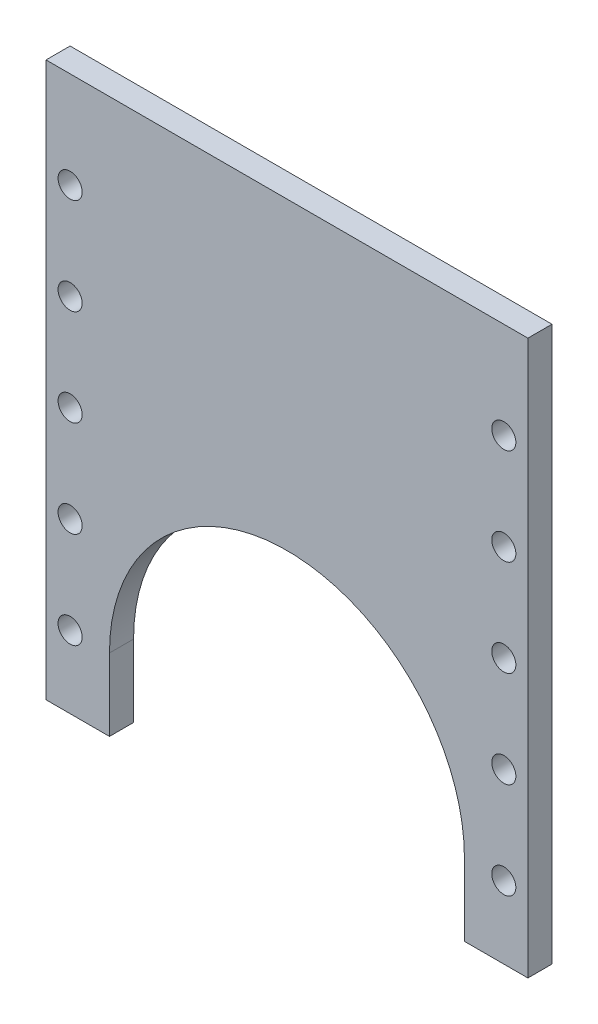
ISO-10303-21;
HEADER;
FILE_DESCRIPTION(('STEP AP214'),'2;1');
FILE_NAME('part.step','',(''),(''),'','','');
FILE_SCHEMA(('AUTOMOTIVE_DESIGN { 1 0 10303 214 1 1 1 1 }'));
ENDSEC;
DATA;
#1=APPLICATION_CONTEXT('core data for automotive mechanical design processes');
#2=APPLICATION_PROTOCOL_DEFINITION('international standard','automotive_design',2000,#1);
#3=PRODUCT_CONTEXT('',#1,'mechanical');
#4=PRODUCT('Part','Part','',(#3));
#5=PRODUCT_RELATED_PRODUCT_CATEGORY('part','',(#4));
#6=PRODUCT_DEFINITION_FORMATION('','',#4);
#7=PRODUCT_DEFINITION_CONTEXT('part definition',#1,'design');
#8=PRODUCT_DEFINITION('design','',#6,#7);
#9=PRODUCT_DEFINITION_SHAPE('','',#8);
#10=(LENGTH_UNIT() NAMED_UNIT(*) SI_UNIT(.MILLI.,.METRE.));
#11=(NAMED_UNIT(*) PLANE_ANGLE_UNIT() SI_UNIT($,.RADIAN.));
#12=(NAMED_UNIT(*) SI_UNIT($,.STERADIAN.) SOLID_ANGLE_UNIT());
#13=UNCERTAINTY_MEASURE_WITH_UNIT(LENGTH_MEASURE(1.E-05),#10,'distance_accuracy_value','');
#14=(GEOMETRIC_REPRESENTATION_CONTEXT(3) GLOBAL_UNCERTAINTY_ASSIGNED_CONTEXT((#13)) GLOBAL_UNIT_ASSIGNED_CONTEXT((#10,
#11,#12)) REPRESENTATION_CONTEXT('',''));
#15=CARTESIAN_POINT('',(0.,0.,0.));
#16=DIRECTION('',(0.,0.,1.));
#17=DIRECTION('',(1.,0.,0.));
#18=AXIS2_PLACEMENT_3D('',#15,#16,#17);
#19=CARTESIAN_POINT('',(0.,0.,5.));
#20=DIRECTION('',(0.,0.,1.));
#21=DIRECTION('',(1.,0.,0.));
#22=AXIS2_PLACEMENT_3D('',#19,#20,#21);
#23=PLANE('',#22);
#24=CARTESIAN_POINT('',(-45.0000000000002,60.,5.));
#25=DIRECTION('',(0.,0.,1.));
#26=DIRECTION('',(1.,0.,0.));
#27=AXIS2_PLACEMENT_3D('',#24,#25,#26);
#28=CIRCLE('',#27,2.5);
#29=CARTESIAN_POINT('',(-42.5000000000002,60.,5.));
#30=VERTEX_POINT('',#29);
#31=EDGE_CURVE('E237',#30,#30,#28,.T.);
#32=ORIENTED_EDGE('',*,*,#31,.F.);
#33=EDGE_LOOP('',(#32));
#34=FACE_BOUND('',#33,.T.);
#35=CARTESIAN_POINT('',(-45.0000000000001,20.,5.));
#36=DIRECTION('',(0.,0.,1.));
#37=DIRECTION('',(1.,0.,0.));
#38=AXIS2_PLACEMENT_3D('',#35,#36,#37);
#39=CIRCLE('',#38,2.5);
#40=CARTESIAN_POINT('',(-42.5000000000001,20.,5.));
#41=VERTEX_POINT('',#40);
#42=EDGE_CURVE('E225',#41,#41,#39,.T.);
#43=ORIENTED_EDGE('',*,*,#42,.F.);
#44=EDGE_LOOP('',(#43));
#45=FACE_BOUND('',#44,.T.);
#46=CARTESIAN_POINT('',(44.9999999999998,60.,5.));
#47=DIRECTION('',(0.,0.,1.));
#48=DIRECTION('',(1.,0.,0.));
#49=AXIS2_PLACEMENT_3D('',#46,#47,#48);
#50=CIRCLE('',#49,2.5);
#51=CARTESIAN_POINT('',(47.4999999999998,60.,5.));
#52=VERTEX_POINT('',#51);
#53=EDGE_CURVE('E213',#52,#52,#50,.T.);
#54=ORIENTED_EDGE('',*,*,#53,.F.);
#55=EDGE_LOOP('',(#54));
#56=FACE_BOUND('',#55,.T.);
#57=CARTESIAN_POINT('',(44.9999999999999,20.,5.));
#58=DIRECTION('',(0.,0.,1.));
#59=DIRECTION('',(1.,0.,0.));
#60=AXIS2_PLACEMENT_3D('',#57,#58,#59);
#61=CIRCLE('',#60,2.5);
#62=CARTESIAN_POINT('',(47.4999999999999,20.,5.));
#63=VERTEX_POINT('',#62);
#64=EDGE_CURVE('E201',#63,#63,#61,.T.);
#65=ORIENTED_EDGE('',*,*,#64,.F.);
#66=EDGE_LOOP('',(#65));
#67=FACE_BOUND('',#66,.T.);
#68=CARTESIAN_POINT('',(-45.,0.,5.));
#69=DIRECTION('',(0.,0.,1.));
#70=DIRECTION('',(1.,0.,0.));
#71=AXIS2_PLACEMENT_3D('',#68,#69,#70);
#72=CIRCLE('',#71,2.5);
#73=CARTESIAN_POINT('',(-42.5,0.,5.));
#74=VERTEX_POINT('',#73);
#75=EDGE_CURVE('E147',#74,#74,#72,.T.);
#76=ORIENTED_EDGE('',*,*,#75,.F.);
#77=EDGE_LOOP('',(#76));
#78=FACE_BOUND('',#77,.T.);
#79=DIRECTION('',(0.,1.,0.));
#80=VECTOR('',#79,1.);
#81=CARTESIAN_POINT('',(50.,-15.,5.));
#82=LINE('',#81,#80);
#83=CARTESIAN_POINT('',(50.,-15.,5.));
#84=VERTEX_POINT('',#83);
#85=CARTESIAN_POINT('',(50.,100.,5.));
#86=VERTEX_POINT('',#85);
#87=EDGE_CURVE('E158',#84,#86,#82,.T.);
#88=ORIENTED_EDGE('',*,*,#87,.T.);
#89=DIRECTION('',(-1.,0.,0.));
#90=VECTOR('',#89,1.);
#91=CARTESIAN_POINT('',(-50.,100.,5.));
#92=LINE('',#91,#90);
#93=CARTESIAN_POINT('',(-50.,100.,5.));
#94=VERTEX_POINT('',#93);
#95=EDGE_CURVE('E106',#86,#94,#92,.T.);
#96=ORIENTED_EDGE('',*,*,#95,.T.);
#97=DIRECTION('',(0.,-1.,0.));
#98=VECTOR('',#97,1.);
#99=CARTESIAN_POINT('',(-50.,-15.,5.));
#100=LINE('',#99,#98);
#101=CARTESIAN_POINT('',(-50.,-15.,5.));
#102=VERTEX_POINT('',#101);
#103=EDGE_CURVE('E173',#94,#102,#100,.T.);
#104=ORIENTED_EDGE('',*,*,#103,.T.);
#105=DIRECTION('',(1.,0.,0.));
#106=VECTOR('',#105,1.);
#107=CARTESIAN_POINT('',(-50.,-15.,5.));
#108=LINE('',#107,#106);
#109=CARTESIAN_POINT('',(-36.83,-15.,5.));
#110=VERTEX_POINT('',#109);
#111=EDGE_CURVE('E186',#102,#110,#108,.T.);
#112=ORIENTED_EDGE('',*,*,#111,.T.);
#113=DIRECTION('',(0.,1.,0.));
#114=VECTOR('',#113,1.);
#115=CARTESIAN_POINT('',(-36.83,0.,5.));
#116=LINE('',#115,#114);
#117=CARTESIAN_POINT('',(-36.83,0.,5.));
#118=VERTEX_POINT('',#117);
#119=EDGE_CURVE('E125',#110,#118,#116,.T.);
#120=ORIENTED_EDGE('',*,*,#119,.T.);
#121=CARTESIAN_POINT('',(0.,0.,5.));
#122=DIRECTION('',(0.,0.,-1.));
#123=DIRECTION('',(1.,0.,0.));
#124=AXIS2_PLACEMENT_3D('',#121,#122,#123);
#125=CIRCLE('',#124,36.83);
#126=CARTESIAN_POINT('',(36.83,0.,5.));
#127=VERTEX_POINT('',#126);
#128=EDGE_CURVE('E119',#118,#127,#125,.T.);
#129=ORIENTED_EDGE('',*,*,#128,.T.);
#130=DIRECTION('',(0.,-1.,0.));
#131=VECTOR('',#130,1.);
#132=CARTESIAN_POINT('',(36.83,0.,5.));
#133=LINE('',#132,#131);
#134=CARTESIAN_POINT('',(36.83,-15.,5.));
#135=VERTEX_POINT('',#134);
#136=EDGE_CURVE('E123',#127,#135,#133,.T.);
#137=ORIENTED_EDGE('',*,*,#136,.T.);
#138=DIRECTION('',(1.,0.,0.));
#139=VECTOR('',#138,1.);
#140=CARTESIAN_POINT('',(36.83,-15.,5.));
#141=LINE('',#140,#139);
#142=EDGE_CURVE('E63',#135,#84,#141,.T.);
#143=ORIENTED_EDGE('',*,*,#142,.T.);
#144=EDGE_LOOP('',(#88,#96,#104,#112,#120,#129,#137,#143));
#145=FACE_BOUND('',#144,.T.);
#146=CARTESIAN_POINT('',(45.,0.,5.));
#147=DIRECTION('',(0.,0.,1.));
#148=DIRECTION('',(1.,0.,0.));
#149=AXIS2_PLACEMENT_3D('',#146,#147,#148);
#150=CIRCLE('',#149,2.5);
#151=CARTESIAN_POINT('',(47.5,0.,5.));
#152=VERTEX_POINT('',#151);
#153=EDGE_CURVE('E195',#152,#152,#150,.T.);
#154=ORIENTED_EDGE('',*,*,#153,.F.);
#155=EDGE_LOOP('',(#154));
#156=FACE_BOUND('',#155,.T.);
#157=CARTESIAN_POINT('',(44.9999999999999,40.,5.));
#158=DIRECTION('',(0.,0.,1.));
#159=DIRECTION('',(1.,0.,0.));
#160=AXIS2_PLACEMENT_3D('',#157,#158,#159);
#161=CIRCLE('',#160,2.5);
#162=CARTESIAN_POINT('',(47.4999999999999,40.,5.));
#163=VERTEX_POINT('',#162);
#164=EDGE_CURVE('E207',#163,#163,#161,.T.);
#165=ORIENTED_EDGE('',*,*,#164,.F.);
#166=EDGE_LOOP('',(#165));
#167=FACE_BOUND('',#166,.T.);
#168=CARTESIAN_POINT('',(44.9999999999997,80.,5.));
#169=DIRECTION('',(0.,0.,1.));
#170=DIRECTION('',(1.,0.,0.));
#171=AXIS2_PLACEMENT_3D('',#168,#169,#170);
#172=CIRCLE('',#171,2.5);
#173=CARTESIAN_POINT('',(47.4999999999997,80.,5.));
#174=VERTEX_POINT('',#173);
#175=EDGE_CURVE('E219',#174,#174,#172,.T.);
#176=ORIENTED_EDGE('',*,*,#175,.F.);
#177=EDGE_LOOP('',(#176));
#178=FACE_BOUND('',#177,.T.);
#179=CARTESIAN_POINT('',(-45.0000000000001,40.,5.));
#180=DIRECTION('',(0.,0.,1.));
#181=DIRECTION('',(1.,0.,0.));
#182=AXIS2_PLACEMENT_3D('',#179,#180,#181);
#183=CIRCLE('',#182,2.5);
#184=CARTESIAN_POINT('',(-42.5000000000001,40.,5.));
#185=VERTEX_POINT('',#184);
#186=EDGE_CURVE('E231',#185,#185,#183,.T.);
#187=ORIENTED_EDGE('',*,*,#186,.F.);
#188=EDGE_LOOP('',(#187));
#189=FACE_BOUND('',#188,.T.);
#190=CARTESIAN_POINT('',(-45.0000000000003,80.,5.));
#191=DIRECTION('',(0.,0.,1.));
#192=DIRECTION('',(1.,0.,0.));
#193=AXIS2_PLACEMENT_3D('',#190,#191,#192);
#194=CIRCLE('',#193,2.5);
#195=CARTESIAN_POINT('',(-42.5000000000003,80.,5.));
#196=VERTEX_POINT('',#195);
#197=EDGE_CURVE('E243',#196,#196,#194,.T.);
#198=ORIENTED_EDGE('',*,*,#197,.F.);
#199=EDGE_LOOP('',(#198));
#200=FACE_BOUND('',#199,.T.);
#201=ADVANCED_FACE('F46',(#34,#45,#56,#67,#78,#145,#156,#167,#178,#189,#200),#23,.T.);
#202=CARTESIAN_POINT('',(0.,0.,0.));
#203=DIRECTION('',(0.,0.,1.));
#204=DIRECTION('',(1.,0.,0.));
#205=AXIS2_PLACEMENT_3D('',#202,#203,#204);
#206=PLANE('',#205);
#207=DIRECTION('',(0.,1.,0.));
#208=VECTOR('',#207,1.);
#209=CARTESIAN_POINT('',(50.,-15.,0.));
#210=LINE('',#209,#208);
#211=CARTESIAN_POINT('',(50.,-15.,0.));
#212=VERTEX_POINT('',#211);
#213=CARTESIAN_POINT('',(50.,100.,0.));
#214=VERTEX_POINT('',#213);
#215=EDGE_CURVE('E143',#212,#214,#210,.T.);
#216=ORIENTED_EDGE('',*,*,#215,.F.);
#217=DIRECTION('',(1.,0.,0.));
#218=VECTOR('',#217,1.);
#219=CARTESIAN_POINT('',(36.83,-15.,0.));
#220=LINE('',#219,#218);
#221=CARTESIAN_POINT('',(36.83,-15.,0.));
#222=VERTEX_POINT('',#221);
#223=EDGE_CURVE('E98',#222,#212,#220,.T.);
#224=ORIENTED_EDGE('',*,*,#223,.F.);
#225=DIRECTION('',(0.,-1.,0.));
#226=VECTOR('',#225,1.);
#227=CARTESIAN_POINT('',(36.83,0.,0.));
#228=LINE('',#227,#226);
#229=CARTESIAN_POINT('',(36.83,0.,0.));
#230=VERTEX_POINT('',#229);
#231=EDGE_CURVE('E92',#230,#222,#228,.T.);
#232=ORIENTED_EDGE('',*,*,#231,.F.);
#233=CARTESIAN_POINT('',(0.,0.,0.));
#234=DIRECTION('',(0.,0.,-1.));
#235=DIRECTION('',(1.,0.,0.));
#236=AXIS2_PLACEMENT_3D('',#233,#234,#235);
#237=CIRCLE('',#236,36.83);
#238=CARTESIAN_POINT('',(-36.83,0.,0.));
#239=VERTEX_POINT('',#238);
#240=EDGE_CURVE('E133',#239,#230,#237,.T.);
#241=ORIENTED_EDGE('',*,*,#240,.F.);
#242=DIRECTION('',(0.,1.,0.));
#243=VECTOR('',#242,1.);
#244=CARTESIAN_POINT('',(-36.83,0.,0.));
#245=LINE('',#244,#243);
#246=CARTESIAN_POINT('',(-36.83,-15.,0.));
#247=VERTEX_POINT('',#246);
#248=EDGE_CURVE('E153',#247,#239,#245,.T.);
#249=ORIENTED_EDGE('',*,*,#248,.F.);
#250=DIRECTION('',(1.,0.,0.));
#251=VECTOR('',#250,1.);
#252=CARTESIAN_POINT('',(-50.,-15.,0.));
#253=LINE('',#252,#251);
#254=CARTESIAN_POINT('',(-50.,-15.,0.));
#255=VERTEX_POINT('',#254);
#256=EDGE_CURVE('E151',#255,#247,#253,.T.);
#257=ORIENTED_EDGE('',*,*,#256,.F.);
#258=DIRECTION('',(0.,-1.,0.));
#259=VECTOR('',#258,1.);
#260=CARTESIAN_POINT('',(-50.,-15.,0.));
#261=LINE('',#260,#259);
#262=CARTESIAN_POINT('',(-50.,100.,0.));
#263=VERTEX_POINT('',#262);
#264=EDGE_CURVE('E149',#263,#255,#261,.T.);
#265=ORIENTED_EDGE('',*,*,#264,.F.);
#266=DIRECTION('',(-1.,0.,0.));
#267=VECTOR('',#266,1.);
#268=CARTESIAN_POINT('',(-50.,100.,0.));
#269=LINE('',#268,#267);
#270=EDGE_CURVE('E146',#214,#263,#269,.T.);
#271=ORIENTED_EDGE('',*,*,#270,.F.);
#272=EDGE_LOOP('',(#216,#224,#232,#241,#249,#257,#265,#271));
#273=FACE_BOUND('',#272,.T.);
#274=CARTESIAN_POINT('',(-45.,0.,0.));
#275=DIRECTION('',(0.,0.,1.));
#276=DIRECTION('',(1.,0.,0.));
#277=AXIS2_PLACEMENT_3D('',#274,#275,#276);
#278=CIRCLE('',#277,2.5);
#279=CARTESIAN_POINT('',(-42.5,0.,0.));
#280=VERTEX_POINT('',#279);
#281=EDGE_CURVE('E192',#280,#280,#278,.T.);
#282=ORIENTED_EDGE('',*,*,#281,.T.);
#283=EDGE_LOOP('',(#282));
#284=FACE_BOUND('',#283,.T.);
#285=CARTESIAN_POINT('',(45.,0.,0.));
#286=DIRECTION('',(0.,0.,1.));
#287=DIRECTION('',(1.,0.,0.));
#288=AXIS2_PLACEMENT_3D('',#285,#286,#287);
#289=CIRCLE('',#288,2.5);
#290=CARTESIAN_POINT('',(47.5,0.,0.));
#291=VERTEX_POINT('',#290);
#292=EDGE_CURVE('E198',#291,#291,#289,.T.);
#293=ORIENTED_EDGE('',*,*,#292,.T.);
#294=EDGE_LOOP('',(#293));
#295=FACE_BOUND('',#294,.T.);
#296=CARTESIAN_POINT('',(44.9999999999999,20.,0.));
#297=DIRECTION('',(0.,0.,1.));
#298=DIRECTION('',(1.,0.,0.));
#299=AXIS2_PLACEMENT_3D('',#296,#297,#298);
#300=CIRCLE('',#299,2.5);
#301=CARTESIAN_POINT('',(47.4999999999999,20.,0.));
#302=VERTEX_POINT('',#301);
#303=EDGE_CURVE('E204',#302,#302,#300,.T.);
#304=ORIENTED_EDGE('',*,*,#303,.T.);
#305=EDGE_LOOP('',(#304));
#306=FACE_BOUND('',#305,.T.);
#307=CARTESIAN_POINT('',(44.9999999999999,40.,0.));
#308=DIRECTION('',(0.,0.,1.));
#309=DIRECTION('',(1.,0.,0.));
#310=AXIS2_PLACEMENT_3D('',#307,#308,#309);
#311=CIRCLE('',#310,2.5);
#312=CARTESIAN_POINT('',(47.4999999999999,40.,0.));
#313=VERTEX_POINT('',#312);
#314=EDGE_CURVE('E210',#313,#313,#311,.T.);
#315=ORIENTED_EDGE('',*,*,#314,.T.);
#316=EDGE_LOOP('',(#315));
#317=FACE_BOUND('',#316,.T.);
#318=CARTESIAN_POINT('',(44.9999999999998,60.,0.));
#319=DIRECTION('',(0.,0.,1.));
#320=DIRECTION('',(1.,0.,0.));
#321=AXIS2_PLACEMENT_3D('',#318,#319,#320);
#322=CIRCLE('',#321,2.5);
#323=CARTESIAN_POINT('',(47.4999999999998,60.,0.));
#324=VERTEX_POINT('',#323);
#325=EDGE_CURVE('E216',#324,#324,#322,.T.);
#326=ORIENTED_EDGE('',*,*,#325,.T.);
#327=EDGE_LOOP('',(#326));
#328=FACE_BOUND('',#327,.T.);
#329=CARTESIAN_POINT('',(44.9999999999997,80.,0.));
#330=DIRECTION('',(0.,0.,1.));
#331=DIRECTION('',(1.,0.,0.));
#332=AXIS2_PLACEMENT_3D('',#329,#330,#331);
#333=CIRCLE('',#332,2.5);
#334=CARTESIAN_POINT('',(47.4999999999997,80.,0.));
#335=VERTEX_POINT('',#334);
#336=EDGE_CURVE('E222',#335,#335,#333,.T.);
#337=ORIENTED_EDGE('',*,*,#336,.T.);
#338=EDGE_LOOP('',(#337));
#339=FACE_BOUND('',#338,.T.);
#340=CARTESIAN_POINT('',(-45.0000000000001,20.,0.));
#341=DIRECTION('',(0.,0.,1.));
#342=DIRECTION('',(1.,0.,0.));
#343=AXIS2_PLACEMENT_3D('',#340,#341,#342);
#344=CIRCLE('',#343,2.5);
#345=CARTESIAN_POINT('',(-42.5000000000001,20.,0.));
#346=VERTEX_POINT('',#345);
#347=EDGE_CURVE('E228',#346,#346,#344,.T.);
#348=ORIENTED_EDGE('',*,*,#347,.T.);
#349=EDGE_LOOP('',(#348));
#350=FACE_BOUND('',#349,.T.);
#351=CARTESIAN_POINT('',(-45.0000000000001,40.,0.));
#352=DIRECTION('',(0.,0.,1.));
#353=DIRECTION('',(1.,0.,0.));
#354=AXIS2_PLACEMENT_3D('',#351,#352,#353);
#355=CIRCLE('',#354,2.5);
#356=CARTESIAN_POINT('',(-42.5000000000001,40.,0.));
#357=VERTEX_POINT('',#356);
#358=EDGE_CURVE('E234',#357,#357,#355,.T.);
#359=ORIENTED_EDGE('',*,*,#358,.T.);
#360=EDGE_LOOP('',(#359));
#361=FACE_BOUND('',#360,.T.);
#362=CARTESIAN_POINT('',(-45.0000000000002,60.,0.));
#363=DIRECTION('',(0.,0.,1.));
#364=DIRECTION('',(1.,0.,0.));
#365=AXIS2_PLACEMENT_3D('',#362,#363,#364);
#366=CIRCLE('',#365,2.5);
#367=CARTESIAN_POINT('',(-42.5000000000002,60.,0.));
#368=VERTEX_POINT('',#367);
#369=EDGE_CURVE('E240',#368,#368,#366,.T.);
#370=ORIENTED_EDGE('',*,*,#369,.T.);
#371=EDGE_LOOP('',(#370));
#372=FACE_BOUND('',#371,.T.);
#373=CARTESIAN_POINT('',(-45.0000000000003,80.,0.));
#374=DIRECTION('',(0.,0.,1.));
#375=DIRECTION('',(1.,0.,0.));
#376=AXIS2_PLACEMENT_3D('',#373,#374,#375);
#377=CIRCLE('',#376,2.5);
#378=CARTESIAN_POINT('',(-42.5000000000003,80.,0.));
#379=VERTEX_POINT('',#378);
#380=EDGE_CURVE('E246',#379,#379,#377,.T.);
#381=ORIENTED_EDGE('',*,*,#380,.T.);
#382=EDGE_LOOP('',(#381));
#383=FACE_BOUND('',#382,.T.);
#384=ADVANCED_FACE('F177',(#273,#284,#295,#306,#317,#328,#339,#350,#361,#372,#383),#206,.F.);
#385=CARTESIAN_POINT('',(50.,-15.,5.));
#386=DIRECTION('',(-1.,0.,0.));
#387=DIRECTION('',(0.,0.,1.));
#388=AXIS2_PLACEMENT_3D('',#385,#386,#387);
#389=PLANE('',#388);
#390=ORIENTED_EDGE('',*,*,#215,.T.);
#391=DIRECTION('',(0.,0.,-1.));
#392=VECTOR('',#391,1.);
#393=CARTESIAN_POINT('',(50.,100.,5.));
#394=LINE('',#393,#392);
#395=EDGE_CURVE('E13',#86,#214,#394,.T.);
#396=ORIENTED_EDGE('',*,*,#395,.F.);
#397=ORIENTED_EDGE('',*,*,#87,.F.);
#398=DIRECTION('',(0.,0.,-1.));
#399=VECTOR('',#398,1.);
#400=CARTESIAN_POINT('',(50.,-15.,5.));
#401=LINE('',#400,#399);
#402=EDGE_CURVE('E139',#84,#212,#401,.T.);
#403=ORIENTED_EDGE('',*,*,#402,.T.);
#404=EDGE_LOOP('',(#390,#396,#397,#403));
#405=FACE_BOUND('',#404,.T.);
#406=ADVANCED_FACE('F48',(#405),#389,.F.);
#407=CARTESIAN_POINT('',(-50.,100.,5.));
#408=DIRECTION('',(0.,-1.,0.));
#409=DIRECTION('',(1.,0.,0.));
#410=AXIS2_PLACEMENT_3D('',#407,#408,#409);
#411=PLANE('',#410);
#412=ORIENTED_EDGE('',*,*,#270,.T.);
#413=DIRECTION('',(0.,0.,-1.));
#414=VECTOR('',#413,1.);
#415=CARTESIAN_POINT('',(-50.,100.,5.));
#416=LINE('',#415,#414);
#417=EDGE_CURVE('E55',#94,#263,#416,.T.);
#418=ORIENTED_EDGE('',*,*,#417,.F.);
#419=ORIENTED_EDGE('',*,*,#95,.F.);
#420=ORIENTED_EDGE('',*,*,#395,.T.);
#421=EDGE_LOOP('',(#412,#418,#419,#420));
#422=FACE_BOUND('',#421,.T.);
#423=ADVANCED_FACE('F280',(#422),#411,.F.);
#424=CARTESIAN_POINT('',(-50.,-15.,5.));
#425=DIRECTION('',(1.,0.,0.));
#426=DIRECTION('',(0.,0.,-1.));
#427=AXIS2_PLACEMENT_3D('',#424,#425,#426);
#428=PLANE('',#427);
#429=ORIENTED_EDGE('',*,*,#264,.T.);
#430=DIRECTION('',(0.,0.,-1.));
#431=VECTOR('',#430,1.);
#432=CARTESIAN_POINT('',(-50.,-15.,5.));
#433=LINE('',#432,#431);
#434=EDGE_CURVE('E165',#102,#255,#433,.T.);
#435=ORIENTED_EDGE('',*,*,#434,.F.);
#436=ORIENTED_EDGE('',*,*,#103,.F.);
#437=ORIENTED_EDGE('',*,*,#417,.T.);
#438=EDGE_LOOP('',(#429,#435,#436,#437));
#439=FACE_BOUND('',#438,.T.);
#440=ADVANCED_FACE('F171',(#439),#428,.F.);
#441=CARTESIAN_POINT('',(-50.,-15.,5.));
#442=DIRECTION('',(0.,1.,0.));
#443=DIRECTION('',(0.,0.,1.));
#444=AXIS2_PLACEMENT_3D('',#441,#442,#443);
#445=PLANE('',#444);
#446=ORIENTED_EDGE('',*,*,#256,.T.);
#447=DIRECTION('',(0.,0.,-1.));
#448=VECTOR('',#447,1.);
#449=CARTESIAN_POINT('',(-36.83,-15.,5.));
#450=LINE('',#449,#448);
#451=EDGE_CURVE('E162',#110,#247,#450,.T.);
#452=ORIENTED_EDGE('',*,*,#451,.F.);
#453=ORIENTED_EDGE('',*,*,#111,.F.);
#454=ORIENTED_EDGE('',*,*,#434,.T.);
#455=EDGE_LOOP('',(#446,#452,#453,#454));
#456=FACE_BOUND('',#455,.T.);
#457=ADVANCED_FACE('F182',(#456),#445,.F.);
#458=CARTESIAN_POINT('',(-36.83,0.,5.));
#459=DIRECTION('',(-1.,0.,0.));
#460=DIRECTION('',(0.,0.,1.));
#461=AXIS2_PLACEMENT_3D('',#458,#459,#460);
#462=PLANE('',#461);
#463=ORIENTED_EDGE('',*,*,#248,.T.);
#464=DIRECTION('',(0.,0.,-1.));
#465=VECTOR('',#464,1.);
#466=CARTESIAN_POINT('',(-36.83,0.,5.));
#467=LINE('',#466,#465);
#468=EDGE_CURVE('E134',#118,#239,#467,.T.);
#469=ORIENTED_EDGE('',*,*,#468,.F.);
#470=ORIENTED_EDGE('',*,*,#119,.F.);
#471=ORIENTED_EDGE('',*,*,#451,.T.);
#472=EDGE_LOOP('',(#463,#469,#470,#471));
#473=FACE_BOUND('',#472,.T.);
#474=ADVANCED_FACE('F185',(#473),#462,.F.);
#475=CARTESIAN_POINT('',(0.,0.,5.));
#476=DIRECTION('',(0.,0.,-1.));
#477=DIRECTION('',(-1.,0.,0.));
#478=AXIS2_PLACEMENT_3D('',#475,#476,#477);
#479=CYLINDRICAL_SURFACE('',#478,36.83);
#480=ORIENTED_EDGE('',*,*,#240,.T.);
#481=DIRECTION('',(0.,0.,-1.));
#482=VECTOR('',#481,1.);
#483=CARTESIAN_POINT('',(36.83,0.,5.));
#484=LINE('',#483,#482);
#485=EDGE_CURVE('E130',#127,#230,#484,.T.);
#486=ORIENTED_EDGE('',*,*,#485,.F.);
#487=ORIENTED_EDGE('',*,*,#128,.F.);
#488=ORIENTED_EDGE('',*,*,#468,.T.);
#489=EDGE_LOOP('',(#480,#486,#487,#488));
#490=FACE_BOUND('',#489,.T.);
#491=ADVANCED_FACE('F131',(#490),#479,.F.);
#492=CARTESIAN_POINT('',(36.83,0.,5.));
#493=DIRECTION('',(1.,0.,0.));
#494=DIRECTION('',(0.,0.,-1.));
#495=AXIS2_PLACEMENT_3D('',#492,#493,#494);
#496=PLANE('',#495);
#497=ORIENTED_EDGE('',*,*,#231,.T.);
#498=DIRECTION('',(0.,0.,-1.));
#499=VECTOR('',#498,1.);
#500=CARTESIAN_POINT('',(36.83,-15.,5.));
#501=LINE('',#500,#499);
#502=EDGE_CURVE('E135',#135,#222,#501,.T.);
#503=ORIENTED_EDGE('',*,*,#502,.F.);
#504=ORIENTED_EDGE('',*,*,#136,.F.);
#505=ORIENTED_EDGE('',*,*,#485,.T.);
#506=EDGE_LOOP('',(#497,#503,#504,#505));
#507=FACE_BOUND('',#506,.T.);
#508=ADVANCED_FACE('F137',(#507),#496,.F.);
#509=CARTESIAN_POINT('',(36.83,-15.,5.));
#510=DIRECTION('',(0.,1.,0.));
#511=DIRECTION('',(0.,0.,1.));
#512=AXIS2_PLACEMENT_3D('',#509,#510,#511);
#513=PLANE('',#512);
#514=ORIENTED_EDGE('',*,*,#223,.T.);
#515=ORIENTED_EDGE('',*,*,#402,.F.);
#516=ORIENTED_EDGE('',*,*,#142,.F.);
#517=ORIENTED_EDGE('',*,*,#502,.T.);
#518=EDGE_LOOP('',(#514,#515,#516,#517));
#519=FACE_BOUND('',#518,.T.);
#520=ADVANCED_FACE('F268',(#519),#513,.F.);
#521=CARTESIAN_POINT('',(-45.,0.,5.));
#522=DIRECTION('',(0.,0.,-1.));
#523=DIRECTION('',(-1.,0.,0.));
#524=AXIS2_PLACEMENT_3D('',#521,#522,#523);
#525=CYLINDRICAL_SURFACE('',#524,2.5);
#526=ORIENTED_EDGE('',*,*,#75,.T.);
#527=EDGE_LOOP('',(#526));
#528=FACE_BOUND('',#527,.T.);
#529=ORIENTED_EDGE('',*,*,#281,.F.);
#530=EDGE_LOOP('',(#529));
#531=FACE_BOUND('',#530,.T.);
#532=ADVANCED_FACE('F265',(#528,#531),#525,.F.);
#533=CARTESIAN_POINT('',(45.,0.,5.));
#534=DIRECTION('',(0.,0.,-1.));
#535=DIRECTION('',(-1.,0.,0.));
#536=AXIS2_PLACEMENT_3D('',#533,#534,#535);
#537=CYLINDRICAL_SURFACE('',#536,2.5);
#538=ORIENTED_EDGE('',*,*,#153,.T.);
#539=EDGE_LOOP('',(#538));
#540=FACE_BOUND('',#539,.T.);
#541=ORIENTED_EDGE('',*,*,#292,.F.);
#542=EDGE_LOOP('',(#541));
#543=FACE_BOUND('',#542,.T.);
#544=ADVANCED_FACE('F344',(#540,#543),#537,.F.);
#545=CARTESIAN_POINT('',(44.9999999999999,20.,5.));
#546=DIRECTION('',(0.,0.,-1.));
#547=DIRECTION('',(-1.,0.,0.));
#548=AXIS2_PLACEMENT_3D('',#545,#546,#547);
#549=CYLINDRICAL_SURFACE('',#548,2.5);
#550=ORIENTED_EDGE('',*,*,#64,.T.);
#551=EDGE_LOOP('',(#550));
#552=FACE_BOUND('',#551,.T.);
#553=ORIENTED_EDGE('',*,*,#303,.F.);
#554=EDGE_LOOP('',(#553));
#555=FACE_BOUND('',#554,.T.);
#556=ADVANCED_FACE('F352',(#552,#555),#549,.F.);
#557=CARTESIAN_POINT('',(44.9999999999999,40.,5.));
#558=DIRECTION('',(0.,0.,-1.));
#559=DIRECTION('',(-1.,0.,0.));
#560=AXIS2_PLACEMENT_3D('',#557,#558,#559);
#561=CYLINDRICAL_SURFACE('',#560,2.5);
#562=ORIENTED_EDGE('',*,*,#164,.T.);
#563=EDGE_LOOP('',(#562));
#564=FACE_BOUND('',#563,.T.);
#565=ORIENTED_EDGE('',*,*,#314,.F.);
#566=EDGE_LOOP('',(#565));
#567=FACE_BOUND('',#566,.T.);
#568=ADVANCED_FACE('F360',(#564,#567),#561,.F.);
#569=CARTESIAN_POINT('',(44.9999999999998,60.,5.));
#570=DIRECTION('',(0.,0.,-1.));
#571=DIRECTION('',(-1.,0.,0.));
#572=AXIS2_PLACEMENT_3D('',#569,#570,#571);
#573=CYLINDRICAL_SURFACE('',#572,2.5);
#574=ORIENTED_EDGE('',*,*,#53,.T.);
#575=EDGE_LOOP('',(#574));
#576=FACE_BOUND('',#575,.T.);
#577=ORIENTED_EDGE('',*,*,#325,.F.);
#578=EDGE_LOOP('',(#577));
#579=FACE_BOUND('',#578,.T.);
#580=ADVANCED_FACE('F369',(#576,#579),#573,.F.);
#581=CARTESIAN_POINT('',(44.9999999999997,80.,5.));
#582=DIRECTION('',(0.,0.,-1.));
#583=DIRECTION('',(-1.,0.,0.));
#584=AXIS2_PLACEMENT_3D('',#581,#582,#583);
#585=CYLINDRICAL_SURFACE('',#584,2.5);
#586=ORIENTED_EDGE('',*,*,#175,.T.);
#587=EDGE_LOOP('',(#586));
#588=FACE_BOUND('',#587,.T.);
#589=ORIENTED_EDGE('',*,*,#336,.F.);
#590=EDGE_LOOP('',(#589));
#591=FACE_BOUND('',#590,.T.);
#592=ADVANCED_FACE('F378',(#588,#591),#585,.F.);
#593=CARTESIAN_POINT('',(-45.0000000000001,20.,5.));
#594=DIRECTION('',(0.,0.,-1.));
#595=DIRECTION('',(-1.,0.,0.));
#596=AXIS2_PLACEMENT_3D('',#593,#594,#595);
#597=CYLINDRICAL_SURFACE('',#596,2.5);
#598=ORIENTED_EDGE('',*,*,#42,.T.);
#599=EDGE_LOOP('',(#598));
#600=FACE_BOUND('',#599,.T.);
#601=ORIENTED_EDGE('',*,*,#347,.F.);
#602=EDGE_LOOP('',(#601));
#603=FACE_BOUND('',#602,.T.);
#604=ADVANCED_FACE('F387',(#600,#603),#597,.F.);
#605=CARTESIAN_POINT('',(-45.0000000000001,40.,5.));
#606=DIRECTION('',(0.,0.,-1.));
#607=DIRECTION('',(-1.,0.,0.));
#608=AXIS2_PLACEMENT_3D('',#605,#606,#607);
#609=CYLINDRICAL_SURFACE('',#608,2.5);
#610=ORIENTED_EDGE('',*,*,#186,.T.);
#611=EDGE_LOOP('',(#610));
#612=FACE_BOUND('',#611,.T.);
#613=ORIENTED_EDGE('',*,*,#358,.F.);
#614=EDGE_LOOP('',(#613));
#615=FACE_BOUND('',#614,.T.);
#616=ADVANCED_FACE('F396',(#612,#615),#609,.F.);
#617=CARTESIAN_POINT('',(-45.0000000000002,60.,5.));
#618=DIRECTION('',(0.,0.,-1.));
#619=DIRECTION('',(-1.,0.,0.));
#620=AXIS2_PLACEMENT_3D('',#617,#618,#619);
#621=CYLINDRICAL_SURFACE('',#620,2.5);
#622=ORIENTED_EDGE('',*,*,#31,.T.);
#623=EDGE_LOOP('',(#622));
#624=FACE_BOUND('',#623,.T.);
#625=ORIENTED_EDGE('',*,*,#369,.F.);
#626=EDGE_LOOP('',(#625));
#627=FACE_BOUND('',#626,.T.);
#628=ADVANCED_FACE('F405',(#624,#627),#621,.F.);
#629=CARTESIAN_POINT('',(-45.0000000000003,80.,5.));
#630=DIRECTION('',(0.,0.,-1.));
#631=DIRECTION('',(-1.,0.,0.));
#632=AXIS2_PLACEMENT_3D('',#629,#630,#631);
#633=CYLINDRICAL_SURFACE('',#632,2.5);
#634=ORIENTED_EDGE('',*,*,#197,.T.);
#635=EDGE_LOOP('',(#634));
#636=FACE_BOUND('',#635,.T.);
#637=ORIENTED_EDGE('',*,*,#380,.F.);
#638=EDGE_LOOP('',(#637));
#639=FACE_BOUND('',#638,.T.);
#640=ADVANCED_FACE('F252',(#636,#639),#633,.F.);
#641=CLOSED_SHELL('',(#201,#384,#406,#423,#440,#457,#474,#491,#508,#520,#532,#544,#556,#568,
#580,#592,#604,#616,#628,#640));
#642=MANIFOLD_SOLID_BREP('B2',#641);
#643=ADVANCED_BREP_SHAPE_REPRESENTATION('',(#18,#642),#14);
#644=SHAPE_DEFINITION_REPRESENTATION(#9,#643);
ENDSEC;
END-ISO-10303-21;
